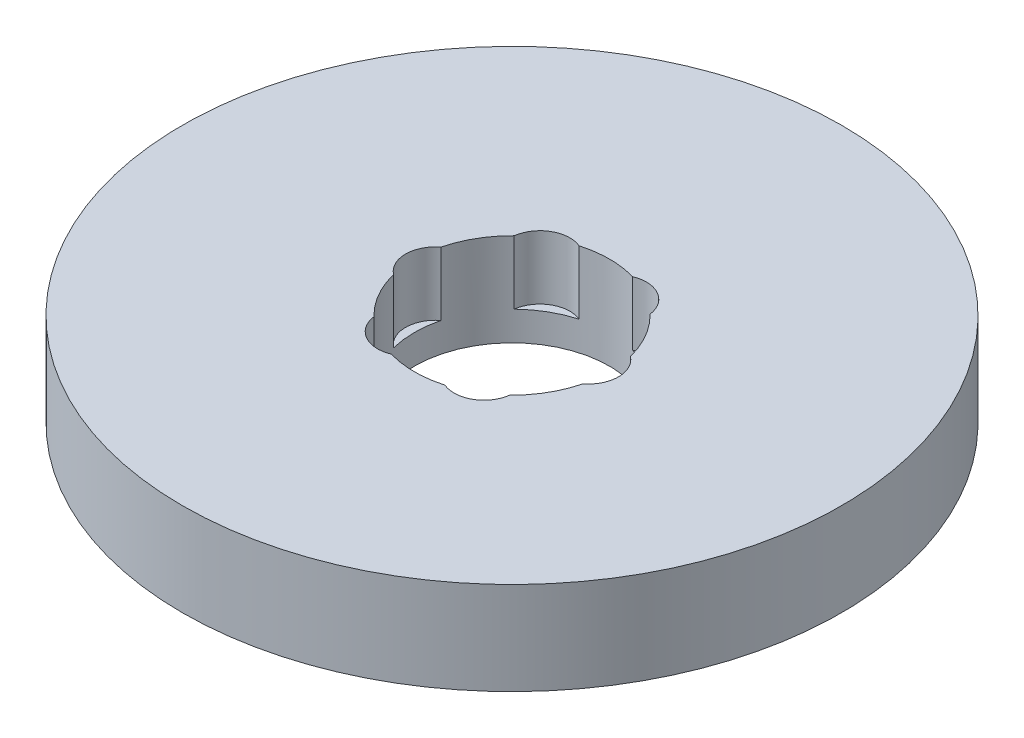
ISO-10303-21;
HEADER;
FILE_DESCRIPTION(('STEP AP214'),'2;1');
FILE_NAME('part.step','',(''),(''),'','','');
FILE_SCHEMA(('AUTOMOTIVE_DESIGN { 1 0 10303 214 1 1 1 1 }'));
ENDSEC;
DATA;
#1=APPLICATION_CONTEXT('core data for automotive mechanical design processes');
#2=APPLICATION_PROTOCOL_DEFINITION('international standard','automotive_design',2000,#1);
#3=PRODUCT_CONTEXT('',#1,'mechanical');
#4=PRODUCT('Part','Part','',(#3));
#5=PRODUCT_RELATED_PRODUCT_CATEGORY('part','',(#4));
#6=PRODUCT_DEFINITION_FORMATION('','',#4);
#7=PRODUCT_DEFINITION_CONTEXT('part definition',#1,'design');
#8=PRODUCT_DEFINITION('design','',#6,#7);
#9=PRODUCT_DEFINITION_SHAPE('','',#8);
#10=(LENGTH_UNIT() NAMED_UNIT(*) SI_UNIT(.MILLI.,.METRE.));
#11=(NAMED_UNIT(*) PLANE_ANGLE_UNIT() SI_UNIT($,.RADIAN.));
#12=(NAMED_UNIT(*) SI_UNIT($,.STERADIAN.) SOLID_ANGLE_UNIT());
#13=UNCERTAINTY_MEASURE_WITH_UNIT(LENGTH_MEASURE(1.E-05),#10,'distance_accuracy_value','');
#14=(GEOMETRIC_REPRESENTATION_CONTEXT(3) GLOBAL_UNCERTAINTY_ASSIGNED_CONTEXT((#13)) GLOBAL_UNIT_ASSIGNED_CONTEXT((#10,
#11,#12)) REPRESENTATION_CONTEXT('',''));
#15=CARTESIAN_POINT('',(0.,0.,0.));
#16=DIRECTION('',(0.,0.,1.));
#17=DIRECTION('',(1.,0.,0.));
#18=AXIS2_PLACEMENT_3D('',#15,#16,#17);
#19=CARTESIAN_POINT('',(0.,19.,0.));
#20=DIRECTION('',(0.,-1.,0.));
#21=DIRECTION('',(0.,0.,-1.));
#22=AXIS2_PLACEMENT_3D('',#19,#20,#21);
#23=CYLINDRICAL_SURFACE('',#22,67.5);
#24=CARTESIAN_POINT('',(0.,19.,0.));
#25=DIRECTION('',(0.,1.,0.));
#26=DIRECTION('',(0.,0.,1.));
#27=AXIS2_PLACEMENT_3D('',#24,#25,#26);
#28=CIRCLE('',#27,67.5);
#29=CARTESIAN_POINT('',(0.,19.,67.5));
#30=VERTEX_POINT('',#29);
#31=EDGE_CURVE('E162',#30,#30,#28,.T.);
#32=ORIENTED_EDGE('',*,*,#31,.F.);
#33=EDGE_LOOP('',(#32));
#34=FACE_BOUND('',#33,.T.);
#35=CARTESIAN_POINT('',(0.,0.,0.));
#36=DIRECTION('',(0.,1.,0.));
#37=DIRECTION('',(0.,0.,1.));
#38=AXIS2_PLACEMENT_3D('',#35,#36,#37);
#39=CIRCLE('',#38,67.5);
#40=CARTESIAN_POINT('',(0.,0.,67.5));
#41=VERTEX_POINT('',#40);
#42=EDGE_CURVE('E157',#41,#41,#39,.T.);
#43=ORIENTED_EDGE('',*,*,#42,.T.);
#44=EDGE_LOOP('',(#43));
#45=FACE_BOUND('',#44,.T.);
#46=ADVANCED_FACE('F39',(#34,#45),#23,.T.);
#47=CARTESIAN_POINT('',(0.,19.,0.));
#48=DIRECTION('',(0.,1.,0.));
#49=DIRECTION('',(0.,0.,1.));
#50=AXIS2_PLACEMENT_3D('',#47,#48,#49);
#51=PLANE('',#50);
#52=CARTESIAN_POINT('',(-7.83607170871985,19.,-13.5724743312555));
#53=DIRECTION('',(0.,1.,0.));
#54=DIRECTION('',(-0.866025403784433,0.,0.50000000000001));
#55=AXIS2_PLACEMENT_3D('',#52,#53,#54);
#56=CIRCLE('',#55,6.12678652993603);
#57=CARTESIAN_POINT('',(-5.48922382086617,19.,-19.2319635462538));
#58=VERTEX_POINT('',#57);
#59=CARTESIAN_POINT('',(-13.9107570852793,19.,-14.3697890490554));
#60=VERTEX_POINT('',#59);
#61=EDGE_CURVE('E218',#58,#60,#56,.T.);
#62=ORIENTED_EDGE('',*,*,#61,.F.);
#63=CARTESIAN_POINT('',(0.,19.,0.));
#64=DIRECTION('',(0.,1.,0.));
#65=DIRECTION('',(0.,0.,1.));
#66=AXIS2_PLACEMENT_3D('',#63,#64,#65);
#67=CIRCLE('',#66,20.);
#68=CARTESIAN_POINT('',(5.48922382086577,19.,-19.2319635462539));
#69=VERTEX_POINT('',#68);
#70=EDGE_CURVE('E169',#69,#58,#67,.T.);
#71=ORIENTED_EDGE('',*,*,#70,.F.);
#72=CARTESIAN_POINT('',(7.83607170871957,19.,-13.5724743312557));
#73=DIRECTION('',(0.,1.,0.));
#74=DIRECTION('',(-0.866025403784443,0.,-0.499999999999992));
#75=AXIS2_PLACEMENT_3D('',#72,#73,#74);
#76=CIRCLE('',#75,6.12678652993603);
#77=CARTESIAN_POINT('',(13.910757085279,19.,-14.3697890490557));
#78=VERTEX_POINT('',#77);
#79=EDGE_CURVE('E285',#78,#69,#76,.T.);
#80=ORIENTED_EDGE('',*,*,#79,.F.);
#81=CARTESIAN_POINT('',(19.3999809061451,19.,-4.86217449719835));
#82=VERTEX_POINT('',#81);
#83=EDGE_CURVE('E174',#82,#78,#67,.T.);
#84=ORIENTED_EDGE('',*,*,#83,.F.);
#85=CARTESIAN_POINT('',(15.6721434174394,19.,0.));
#86=DIRECTION('',(0.,1.,0.));
#87=DIRECTION('',(0.,0.,-1.));
#88=AXIS2_PLACEMENT_3D('',#85,#86,#87);
#89=CIRCLE('',#88,6.12678652993603);
#90=CARTESIAN_POINT('',(19.3999809061451,19.,4.86217449719835));
#91=VERTEX_POINT('',#90);
#92=EDGE_CURVE('E280',#91,#82,#89,.T.);
#93=ORIENTED_EDGE('',*,*,#92,.F.);
#94=CARTESIAN_POINT('',(13.9107570852792,19.,14.3697890490555));
#95=VERTEX_POINT('',#94);
#96=EDGE_CURVE('E164',#95,#91,#67,.T.);
#97=ORIENTED_EDGE('',*,*,#96,.F.);
#98=CARTESIAN_POINT('',(7.83607170871976,19.,13.5724743312555));
#99=DIRECTION('',(0.,1.,0.));
#100=DIRECTION('',(0.866025403784436,0.,-0.500000000000004));
#101=AXIS2_PLACEMENT_3D('',#98,#99,#100);
#102=CIRCLE('',#101,6.12678652993603);
#103=CARTESIAN_POINT('',(5.48922382086603,19.,19.2319635462538));
#104=VERTEX_POINT('',#103);
#105=EDGE_CURVE('E269',#104,#95,#102,.T.);
#106=ORIENTED_EDGE('',*,*,#105,.F.);
#107=CARTESIAN_POINT('',(-5.4892238208659,19.,19.2319635462539));
#108=VERTEX_POINT('',#107);
#109=EDGE_CURVE('E149',#108,#104,#67,.T.);
#110=ORIENTED_EDGE('',*,*,#109,.F.);
#111=CARTESIAN_POINT('',(-7.83607170871966,19.,13.5724743312556));
#112=DIRECTION('',(0.,1.,0.));
#113=DIRECTION('',(0.86602540378444,0.,0.499999999999998));
#114=AXIS2_PLACEMENT_3D('',#111,#112,#113);
#115=CIRCLE('',#114,6.12678652993603);
#116=CARTESIAN_POINT('',(-13.9107570852791,19.,14.3697890490556));
#117=VERTEX_POINT('',#116);
#118=EDGE_CURVE('E128',#117,#108,#115,.T.);
#119=ORIENTED_EDGE('',*,*,#118,.F.);
#120=CARTESIAN_POINT('',(-19.3999809061451,19.,4.86217449719835));
#121=VERTEX_POINT('',#120);
#122=EDGE_CURVE('E148',#121,#117,#67,.T.);
#123=ORIENTED_EDGE('',*,*,#122,.F.);
#124=CARTESIAN_POINT('',(-15.6721434174394,19.,0.));
#125=DIRECTION('',(0.,1.,0.));
#126=DIRECTION('',(0.,0.,1.));
#127=AXIS2_PLACEMENT_3D('',#124,#125,#126);
#128=CIRCLE('',#127,6.12678652993603);
#129=CARTESIAN_POINT('',(-19.3999809061451,19.,-4.86217449719835));
#130=VERTEX_POINT('',#129);
#131=EDGE_CURVE('E179',#130,#121,#128,.T.);
#132=ORIENTED_EDGE('',*,*,#131,.F.);
#133=EDGE_CURVE('E161',#60,#130,#67,.T.);
#134=ORIENTED_EDGE('',*,*,#133,.F.);
#135=EDGE_LOOP('',(#62,#71,#80,#84,#93,#97,#106,#110,#119,#123,#132,#134));
#136=FACE_BOUND('',#135,.T.);
#137=ORIENTED_EDGE('',*,*,#31,.T.);
#138=EDGE_LOOP('',(#137));
#139=FACE_BOUND('',#138,.T.);
#140=ADVANCED_FACE('F141',(#136,#139),#51,.T.);
#141=CARTESIAN_POINT('',(0.,0.,0.));
#142=DIRECTION('',(0.,1.,0.));
#143=DIRECTION('',(0.,0.,1.));
#144=AXIS2_PLACEMENT_3D('',#141,#142,#143);
#145=PLANE('',#144);
#146=CARTESIAN_POINT('',(0.,0.,0.));
#147=DIRECTION('',(0.,1.,0.));
#148=DIRECTION('',(0.,0.,1.));
#149=AXIS2_PLACEMENT_3D('',#146,#147,#148);
#150=CIRCLE('',#149,20.);
#151=CARTESIAN_POINT('',(0.,0.,20.));
#152=VERTEX_POINT('',#151);
#153=EDGE_CURVE('E166',#152,#152,#150,.T.);
#154=ORIENTED_EDGE('',*,*,#153,.T.);
#155=EDGE_LOOP('',(#154));
#156=FACE_BOUND('',#155,.T.);
#157=ORIENTED_EDGE('',*,*,#42,.F.);
#158=EDGE_LOOP('',(#157));
#159=FACE_BOUND('',#158,.T.);
#160=ADVANCED_FACE('F234',(#156,#159),#145,.F.);
#161=CARTESIAN_POINT('',(0.,19.,0.));
#162=DIRECTION('',(0.,-1.,0.));
#163=DIRECTION('',(0.,0.,-1.));
#164=AXIS2_PLACEMENT_3D('',#161,#162,#163);
#165=CYLINDRICAL_SURFACE('',#164,20.);
#166=DIRECTION('',(0.,1.,0.));
#167=VECTOR('',#166,1.);
#168=CARTESIAN_POINT('',(-5.48922382086616,12.4902840487317,-19.2319635462538));
#169=LINE('',#168,#167);
#170=CARTESIAN_POINT('',(-5.48922382086617,5.98056809746338,-19.2319635462538));
#171=VERTEX_POINT('',#170);
#172=EDGE_CURVE('E11',#171,#58,#169,.T.);
#173=ORIENTED_EDGE('',*,*,#172,.F.);
#174=CARTESIAN_POINT('',(0.,5.98056809746338,0.));
#175=DIRECTION('',(0.,1.,0.));
#176=DIRECTION('',(0.,0.,1.));
#177=AXIS2_PLACEMENT_3D('',#174,#175,#176);
#178=CIRCLE('',#177,20.);
#179=CARTESIAN_POINT('',(-13.9107570852793,5.98056809746338,-14.3697890490554));
#180=VERTEX_POINT('',#179);
#181=EDGE_CURVE('E214',#171,#180,#178,.T.);
#182=ORIENTED_EDGE('',*,*,#181,.T.);
#183=DIRECTION('',(0.,1.,0.));
#184=VECTOR('',#183,1.);
#185=CARTESIAN_POINT('',(-13.9107570852793,12.4902840487317,-14.3697890490554));
#186=LINE('',#185,#184);
#187=EDGE_CURVE('E46',#60,#180,#186,.F.);
#188=ORIENTED_EDGE('',*,*,#187,.F.);
#189=ORIENTED_EDGE('',*,*,#133,.T.);
#190=DIRECTION('',(0.,1.,0.));
#191=VECTOR('',#190,1.);
#192=CARTESIAN_POINT('',(-19.3999809061451,12.4902840487317,-4.86217449719835));
#193=LINE('',#192,#191);
#194=CARTESIAN_POINT('',(-19.3999809061451,5.98056809746338,-4.86217449719835));
#195=VERTEX_POINT('',#194);
#196=EDGE_CURVE('E187',#195,#130,#193,.T.);
#197=ORIENTED_EDGE('',*,*,#196,.F.);
#198=CARTESIAN_POINT('',(0.,5.98056809746338,0.));
#199=DIRECTION('',(0.,1.,0.));
#200=DIRECTION('',(0.,0.,1.));
#201=AXIS2_PLACEMENT_3D('',#198,#199,#200);
#202=CIRCLE('',#201,20.);
#203=CARTESIAN_POINT('',(-19.3999809061451,5.98056809746338,4.86217449719835));
#204=VERTEX_POINT('',#203);
#205=EDGE_CURVE('E184',#195,#204,#202,.T.);
#206=ORIENTED_EDGE('',*,*,#205,.T.);
#207=DIRECTION('',(0.,1.,0.));
#208=VECTOR('',#207,1.);
#209=CARTESIAN_POINT('',(-19.3999809061451,12.4902840487317,4.86217449719835));
#210=LINE('',#209,#208);
#211=EDGE_CURVE('E158',#121,#204,#210,.F.);
#212=ORIENTED_EDGE('',*,*,#211,.F.);
#213=ORIENTED_EDGE('',*,*,#122,.T.);
#214=DIRECTION('',(0.,1.,0.));
#215=VECTOR('',#214,1.);
#216=CARTESIAN_POINT('',(-13.9107570852791,12.4902840487317,14.3697890490556));
#217=LINE('',#216,#215);
#218=CARTESIAN_POINT('',(-13.9107570852791,5.98056809746338,14.3697890490556));
#219=VERTEX_POINT('',#218);
#220=EDGE_CURVE('E127',#219,#117,#217,.T.);
#221=ORIENTED_EDGE('',*,*,#220,.F.);
#222=CARTESIAN_POINT('',(0.,5.98056809746338,0.));
#223=DIRECTION('',(0.,1.,0.));
#224=DIRECTION('',(0.,0.,1.));
#225=AXIS2_PLACEMENT_3D('',#222,#223,#224);
#226=CIRCLE('',#225,20.);
#227=CARTESIAN_POINT('',(-5.4892238208659,5.98056809746338,19.2319635462539));
#228=VERTEX_POINT('',#227);
#229=EDGE_CURVE('E189',#219,#228,#226,.T.);
#230=ORIENTED_EDGE('',*,*,#229,.T.);
#231=DIRECTION('',(0.,1.,0.));
#232=VECTOR('',#231,1.);
#233=CARTESIAN_POINT('',(-5.48922382086589,12.4902840487317,19.2319635462539));
#234=LINE('',#233,#232);
#235=EDGE_CURVE('E140',#108,#228,#234,.F.);
#236=ORIENTED_EDGE('',*,*,#235,.F.);
#237=ORIENTED_EDGE('',*,*,#109,.T.);
#238=DIRECTION('',(0.,1.,0.));
#239=VECTOR('',#238,1.);
#240=CARTESIAN_POINT('',(5.48922382086603,12.4902840487317,19.2319635462538));
#241=LINE('',#240,#239);
#242=CARTESIAN_POINT('',(5.48922382086603,5.98056809746338,19.2319635462538));
#243=VERTEX_POINT('',#242);
#244=EDGE_CURVE('E196',#243,#104,#241,.T.);
#245=ORIENTED_EDGE('',*,*,#244,.F.);
#246=CARTESIAN_POINT('',(0.,5.98056809746338,0.));
#247=DIRECTION('',(0.,1.,0.));
#248=DIRECTION('',(0.,0.,1.));
#249=AXIS2_PLACEMENT_3D('',#246,#247,#248);
#250=CIRCLE('',#249,20.);
#251=CARTESIAN_POINT('',(13.9107570852792,5.98056809746338,14.3697890490555));
#252=VERTEX_POINT('',#251);
#253=EDGE_CURVE('E136',#243,#252,#250,.T.);
#254=ORIENTED_EDGE('',*,*,#253,.T.);
#255=DIRECTION('',(0.,1.,0.));
#256=VECTOR('',#255,1.);
#257=CARTESIAN_POINT('',(13.9107570852792,12.4902840487317,14.3697890490555));
#258=LINE('',#257,#256);
#259=EDGE_CURVE('E194',#95,#252,#258,.F.);
#260=ORIENTED_EDGE('',*,*,#259,.F.);
#261=ORIENTED_EDGE('',*,*,#96,.T.);
#262=DIRECTION('',(0.,1.,0.));
#263=VECTOR('',#262,1.);
#264=CARTESIAN_POINT('',(19.3999809061451,12.4902840487317,4.86217449719835));
#265=LINE('',#264,#263);
#266=CARTESIAN_POINT('',(19.3999809061451,5.98056809746338,4.86217449719835));
#267=VERTEX_POINT('',#266);
#268=EDGE_CURVE('E206',#267,#91,#265,.T.);
#269=ORIENTED_EDGE('',*,*,#268,.F.);
#270=CARTESIAN_POINT('',(0.,5.98056809746338,0.));
#271=DIRECTION('',(0.,1.,0.));
#272=DIRECTION('',(0.,0.,1.));
#273=AXIS2_PLACEMENT_3D('',#270,#271,#272);
#274=CIRCLE('',#273,20.);
#275=CARTESIAN_POINT('',(19.3999809061451,5.98056809746338,-4.86217449719835));
#276=VERTEX_POINT('',#275);
#277=EDGE_CURVE('E199',#267,#276,#274,.T.);
#278=ORIENTED_EDGE('',*,*,#277,.T.);
#279=DIRECTION('',(0.,1.,0.));
#280=VECTOR('',#279,1.);
#281=CARTESIAN_POINT('',(19.3999809061451,12.4902840487317,-4.86217449719835));
#282=LINE('',#281,#280);
#283=EDGE_CURVE('E201',#82,#276,#282,.F.);
#284=ORIENTED_EDGE('',*,*,#283,.F.);
#285=ORIENTED_EDGE('',*,*,#83,.T.);
#286=DIRECTION('',(0.,1.,0.));
#287=VECTOR('',#286,1.);
#288=CARTESIAN_POINT('',(13.910757085279,12.4902840487317,-14.3697890490557));
#289=LINE('',#288,#287);
#290=CARTESIAN_POINT('',(13.910757085279,5.98056809746338,-14.3697890490557));
#291=VERTEX_POINT('',#290);
#292=EDGE_CURVE('E213',#291,#78,#289,.T.);
#293=ORIENTED_EDGE('',*,*,#292,.F.);
#294=CARTESIAN_POINT('',(0.,5.98056809746338,0.));
#295=DIRECTION('',(0.,1.,0.));
#296=DIRECTION('',(0.,0.,1.));
#297=AXIS2_PLACEMENT_3D('',#294,#295,#296);
#298=CIRCLE('',#297,20.);
#299=CARTESIAN_POINT('',(5.48922382086577,5.98056809746338,-19.2319635462539));
#300=VERTEX_POINT('',#299);
#301=EDGE_CURVE('E208',#291,#300,#298,.T.);
#302=ORIENTED_EDGE('',*,*,#301,.T.);
#303=DIRECTION('',(0.,1.,0.));
#304=VECTOR('',#303,1.);
#305=CARTESIAN_POINT('',(5.48922382086576,12.4902840487317,-19.2319635462539));
#306=LINE('',#305,#304);
#307=EDGE_CURVE('E211',#69,#300,#306,.F.);
#308=ORIENTED_EDGE('',*,*,#307,.F.);
#309=ORIENTED_EDGE('',*,*,#70,.T.);
#310=EDGE_LOOP('',(#173,#182,#188,#189,#197,#206,#212,#213,#221,#230,#236,#237,#245,#254,#260,
#261,#269,#278,#284,#285,#293,#302,#308,#309));
#311=FACE_BOUND('',#310,.T.);
#312=ORIENTED_EDGE('',*,*,#153,.F.);
#313=EDGE_LOOP('',(#312));
#314=FACE_BOUND('',#313,.T.);
#315=ADVANCED_FACE('F152',(#311,#314),#165,.F.);
#316=CARTESIAN_POINT('',(-15.6721434174394,5.98056809746338,0.));
#317=DIRECTION('',(0.,1.,0.));
#318=DIRECTION('',(0.,0.,1.));
#319=AXIS2_PLACEMENT_3D('',#316,#317,#318);
#320=CYLINDRICAL_SURFACE('',#319,6.12678652993603);
#321=ORIENTED_EDGE('',*,*,#196,.T.);
#322=ORIENTED_EDGE('',*,*,#131,.T.);
#323=ORIENTED_EDGE('',*,*,#211,.T.);
#324=CARTESIAN_POINT('',(-15.6721434174394,5.98056809746338,0.));
#325=DIRECTION('',(0.,1.,0.));
#326=DIRECTION('',(0.,0.,1.));
#327=AXIS2_PLACEMENT_3D('',#324,#325,#326);
#328=CIRCLE('',#327,6.12678652993603);
#329=EDGE_CURVE('E180',#195,#204,#328,.T.);
#330=ORIENTED_EDGE('',*,*,#329,.F.);
#331=EDGE_LOOP('',(#321,#322,#323,#330));
#332=FACE_BOUND('',#331,.T.);
#333=ADVANCED_FACE('F244',(#332),#320,.F.);
#334=CARTESIAN_POINT('',(-15.6721434174394,5.98056809746338,0.));
#335=DIRECTION('',(0.,1.,0.));
#336=DIRECTION('',(0.,0.,1.));
#337=AXIS2_PLACEMENT_3D('',#334,#335,#336);
#338=PLANE('',#337);
#339=ORIENTED_EDGE('',*,*,#329,.T.);
#340=ORIENTED_EDGE('',*,*,#205,.F.);
#341=EDGE_LOOP('',(#339,#340));
#342=FACE_BOUND('',#341,.T.);
#343=ADVANCED_FACE('F248',(#342),#338,.T.);
#344=CARTESIAN_POINT('',(-7.83607170871966,5.98056809746338,13.5724743312556));
#345=DIRECTION('',(0.,1.,0.));
#346=DIRECTION('',(0.,0.,1.));
#347=AXIS2_PLACEMENT_3D('',#344,#345,#346);
#348=CYLINDRICAL_SURFACE('',#347,6.12678652993603);
#349=ORIENTED_EDGE('',*,*,#220,.T.);
#350=ORIENTED_EDGE('',*,*,#118,.T.);
#351=ORIENTED_EDGE('',*,*,#235,.T.);
#352=CARTESIAN_POINT('',(-7.83607170871966,5.98056809746338,13.5724743312556));
#353=DIRECTION('',(0.,1.,0.));
#354=DIRECTION('',(0.86602540378444,0.,0.499999999999998));
#355=AXIS2_PLACEMENT_3D('',#352,#353,#354);
#356=CIRCLE('',#355,6.12678652993603);
#357=EDGE_CURVE('E135',#219,#228,#356,.T.);
#358=ORIENTED_EDGE('',*,*,#357,.F.);
#359=EDGE_LOOP('',(#349,#350,#351,#358));
#360=FACE_BOUND('',#359,.T.);
#361=ADVANCED_FACE('F126',(#360),#348,.F.);
#362=CARTESIAN_POINT('',(-7.83607170871966,5.98056809746338,13.5724743312556));
#363=DIRECTION('',(0.,1.,0.));
#364=DIRECTION('',(0.86602540378444,0.,0.499999999999998));
#365=AXIS2_PLACEMENT_3D('',#362,#363,#364);
#366=PLANE('',#365);
#367=ORIENTED_EDGE('',*,*,#357,.T.);
#368=ORIENTED_EDGE('',*,*,#229,.F.);
#369=EDGE_LOOP('',(#367,#368));
#370=FACE_BOUND('',#369,.T.);
#371=ADVANCED_FACE('F258',(#370),#366,.T.);
#372=CARTESIAN_POINT('',(7.83607170871976,5.98056809746338,13.5724743312555));
#373=DIRECTION('',(0.,1.,0.));
#374=DIRECTION('',(0.,0.,1.));
#375=AXIS2_PLACEMENT_3D('',#372,#373,#374);
#376=CYLINDRICAL_SURFACE('',#375,6.12678652993603);
#377=ORIENTED_EDGE('',*,*,#244,.T.);
#378=ORIENTED_EDGE('',*,*,#105,.T.);
#379=ORIENTED_EDGE('',*,*,#259,.T.);
#380=CARTESIAN_POINT('',(7.83607170871976,5.98056809746338,13.5724743312555));
#381=DIRECTION('',(0.,1.,0.));
#382=DIRECTION('',(0.866025403784436,0.,-0.500000000000004));
#383=AXIS2_PLACEMENT_3D('',#380,#381,#382);
#384=CIRCLE('',#383,6.12678652993603);
#385=EDGE_CURVE('E147',#243,#252,#384,.T.);
#386=ORIENTED_EDGE('',*,*,#385,.F.);
#387=EDGE_LOOP('',(#377,#378,#379,#386));
#388=FACE_BOUND('',#387,.T.);
#389=ADVANCED_FACE('F256',(#388),#376,.F.);
#390=CARTESIAN_POINT('',(7.83607170871976,5.98056809746338,13.5724743312555));
#391=DIRECTION('',(0.,1.,0.));
#392=DIRECTION('',(0.866025403784436,0.,-0.500000000000004));
#393=AXIS2_PLACEMENT_3D('',#390,#391,#392);
#394=PLANE('',#393);
#395=ORIENTED_EDGE('',*,*,#385,.T.);
#396=ORIENTED_EDGE('',*,*,#253,.F.);
#397=EDGE_LOOP('',(#395,#396));
#398=FACE_BOUND('',#397,.T.);
#399=ADVANCED_FACE('F263',(#398),#394,.T.);
#400=CARTESIAN_POINT('',(15.6721434174394,5.98056809746338,0.));
#401=DIRECTION('',(0.,1.,0.));
#402=DIRECTION('',(0.,0.,1.));
#403=AXIS2_PLACEMENT_3D('',#400,#401,#402);
#404=CYLINDRICAL_SURFACE('',#403,6.12678652993603);
#405=ORIENTED_EDGE('',*,*,#268,.T.);
#406=ORIENTED_EDGE('',*,*,#92,.T.);
#407=ORIENTED_EDGE('',*,*,#283,.T.);
#408=CARTESIAN_POINT('',(15.6721434174394,5.98056809746338,0.));
#409=DIRECTION('',(0.,1.,0.));
#410=DIRECTION('',(0.,0.,-1.));
#411=AXIS2_PLACEMENT_3D('',#408,#409,#410);
#412=CIRCLE('',#411,6.12678652993603);
#413=EDGE_CURVE('E273',#267,#276,#412,.T.);
#414=ORIENTED_EDGE('',*,*,#413,.F.);
#415=EDGE_LOOP('',(#405,#406,#407,#414));
#416=FACE_BOUND('',#415,.T.);
#417=ADVANCED_FACE('F297',(#416),#404,.F.);
#418=CARTESIAN_POINT('',(15.6721434174394,5.98056809746338,0.));
#419=DIRECTION('',(0.,1.,0.));
#420=DIRECTION('',(0.,0.,-1.));
#421=AXIS2_PLACEMENT_3D('',#418,#419,#420);
#422=PLANE('',#421);
#423=ORIENTED_EDGE('',*,*,#413,.T.);
#424=ORIENTED_EDGE('',*,*,#277,.F.);
#425=EDGE_LOOP('',(#423,#424));
#426=FACE_BOUND('',#425,.T.);
#427=ADVANCED_FACE('F299',(#426),#422,.T.);
#428=CARTESIAN_POINT('',(7.83607170871957,5.98056809746338,-13.5724743312557));
#429=DIRECTION('',(0.,1.,0.));
#430=DIRECTION('',(0.,0.,1.));
#431=AXIS2_PLACEMENT_3D('',#428,#429,#430);
#432=CYLINDRICAL_SURFACE('',#431,6.12678652993603);
#433=ORIENTED_EDGE('',*,*,#292,.T.);
#434=ORIENTED_EDGE('',*,*,#79,.T.);
#435=ORIENTED_EDGE('',*,*,#307,.T.);
#436=CARTESIAN_POINT('',(7.83607170871957,5.98056809746338,-13.5724743312557));
#437=DIRECTION('',(0.,1.,0.));
#438=DIRECTION('',(-0.866025403784443,0.,-0.499999999999992));
#439=AXIS2_PLACEMENT_3D('',#436,#437,#438);
#440=CIRCLE('',#439,6.12678652993603);
#441=EDGE_CURVE('E56',#291,#300,#440,.T.);
#442=ORIENTED_EDGE('',*,*,#441,.F.);
#443=EDGE_LOOP('',(#433,#434,#435,#442));
#444=FACE_BOUND('',#443,.T.);
#445=ADVANCED_FACE('F292',(#444),#432,.F.);
#446=CARTESIAN_POINT('',(7.83607170871957,5.98056809746338,-13.5724743312557));
#447=DIRECTION('',(0.,1.,0.));
#448=DIRECTION('',(-0.866025403784443,0.,-0.499999999999992));
#449=AXIS2_PLACEMENT_3D('',#446,#447,#448);
#450=PLANE('',#449);
#451=ORIENTED_EDGE('',*,*,#441,.T.);
#452=ORIENTED_EDGE('',*,*,#301,.F.);
#453=EDGE_LOOP('',(#451,#452));
#454=FACE_BOUND('',#453,.T.);
#455=ADVANCED_FACE('F226',(#454),#450,.T.);
#456=CARTESIAN_POINT('',(-7.83607170871985,5.98056809746338,-13.5724743312555));
#457=DIRECTION('',(0.,1.,0.));
#458=DIRECTION('',(0.,0.,1.));
#459=AXIS2_PLACEMENT_3D('',#456,#457,#458);
#460=CYLINDRICAL_SURFACE('',#459,6.12678652993603);
#461=ORIENTED_EDGE('',*,*,#172,.T.);
#462=ORIENTED_EDGE('',*,*,#61,.T.);
#463=ORIENTED_EDGE('',*,*,#187,.T.);
#464=CARTESIAN_POINT('',(-7.83607170871985,5.98056809746338,-13.5724743312555));
#465=DIRECTION('',(0.,1.,0.));
#466=DIRECTION('',(-0.866025403784433,0.,0.50000000000001));
#467=AXIS2_PLACEMENT_3D('',#464,#465,#466);
#468=CIRCLE('',#467,6.12678652993603);
#469=EDGE_CURVE('E55',#171,#180,#468,.T.);
#470=ORIENTED_EDGE('',*,*,#469,.F.);
#471=EDGE_LOOP('',(#461,#462,#463,#470));
#472=FACE_BOUND('',#471,.T.);
#473=ADVANCED_FACE('F217',(#472),#460,.F.);
#474=CARTESIAN_POINT('',(-7.83607170871985,5.98056809746338,-13.5724743312555));
#475=DIRECTION('',(0.,1.,0.));
#476=DIRECTION('',(-0.866025403784433,0.,0.50000000000001));
#477=AXIS2_PLACEMENT_3D('',#474,#475,#476);
#478=PLANE('',#477);
#479=ORIENTED_EDGE('',*,*,#469,.T.);
#480=ORIENTED_EDGE('',*,*,#181,.F.);
#481=EDGE_LOOP('',(#479,#480));
#482=FACE_BOUND('',#481,.T.);
#483=ADVANCED_FACE('F219',(#482),#478,.T.);
#484=CLOSED_SHELL('',(#46,#140,#160,#315,#333,#343,#361,#371,#389,#399,#417,#427,#445,#455,#473,#483));
#485=MANIFOLD_SOLID_BREP('B2',#484);
#486=ADVANCED_BREP_SHAPE_REPRESENTATION('',(#18,#485),#14);
#487=SHAPE_DEFINITION_REPRESENTATION(#9,#486);
ENDSEC;
END-ISO-10303-21;
